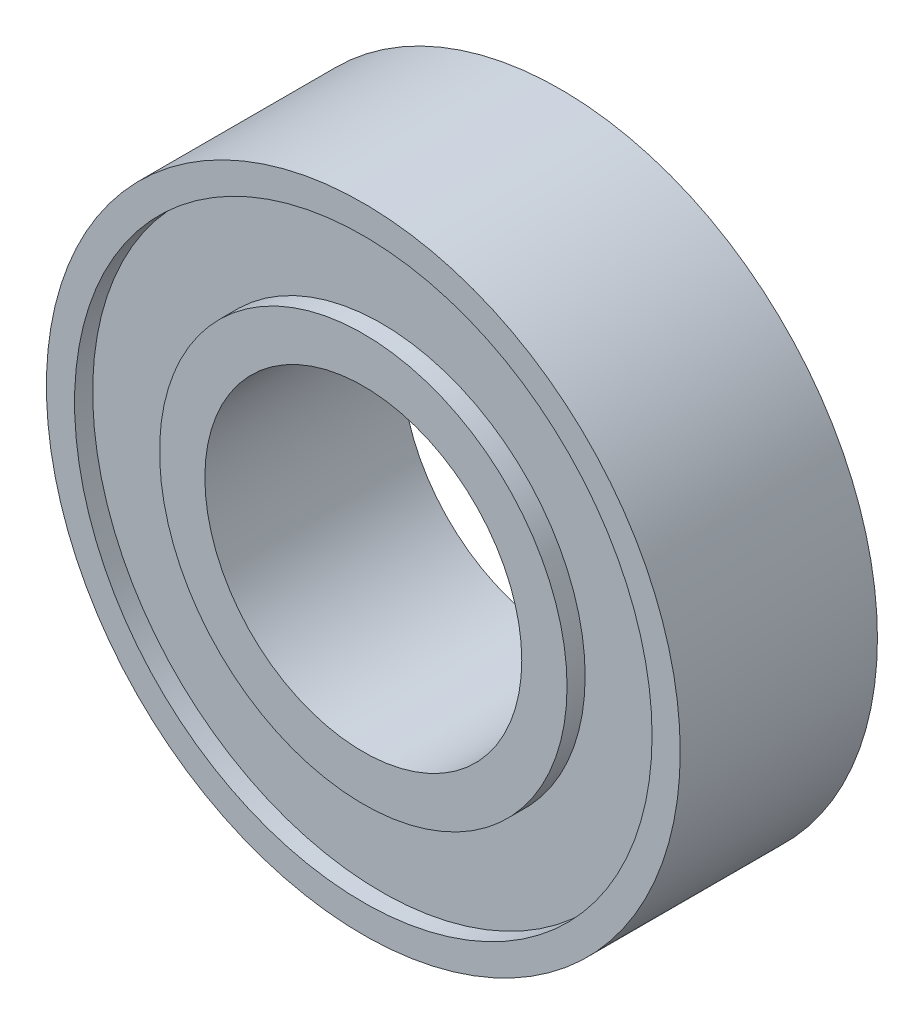
ISO-10303-21;
HEADER;
FILE_DESCRIPTION(('STEP AP214'),'2;1');
FILE_NAME('part.step','',(''),(''),'','','');
FILE_SCHEMA(('AUTOMOTIVE_DESIGN { 1 0 10303 214 1 1 1 1 }'));
ENDSEC;
DATA;
#1=APPLICATION_CONTEXT('core data for automotive mechanical design processes');
#2=APPLICATION_PROTOCOL_DEFINITION('international standard','automotive_design',2000,#1);
#3=PRODUCT_CONTEXT('',#1,'mechanical');
#4=PRODUCT('Part','Part','',(#3));
#5=PRODUCT_RELATED_PRODUCT_CATEGORY('part','',(#4));
#6=PRODUCT_DEFINITION_FORMATION('','',#4);
#7=PRODUCT_DEFINITION_CONTEXT('part definition',#1,'design');
#8=PRODUCT_DEFINITION('design','',#6,#7);
#9=PRODUCT_DEFINITION_SHAPE('','',#8);
#10=(LENGTH_UNIT() NAMED_UNIT(*) SI_UNIT(.MILLI.,.METRE.));
#11=(NAMED_UNIT(*) PLANE_ANGLE_UNIT() SI_UNIT($,.RADIAN.));
#12=(NAMED_UNIT(*) SI_UNIT($,.STERADIAN.) SOLID_ANGLE_UNIT());
#13=UNCERTAINTY_MEASURE_WITH_UNIT(LENGTH_MEASURE(1.E-05),#10,'distance_accuracy_value','');
#14=(GEOMETRIC_REPRESENTATION_CONTEXT(3) GLOBAL_UNCERTAINTY_ASSIGNED_CONTEXT((#13)) GLOBAL_UNIT_ASSIGNED_CONTEXT((#10,
#11,#12)) REPRESENTATION_CONTEXT('',''));
#15=CARTESIAN_POINT('',(0.,0.,0.));
#16=DIRECTION('',(0.,0.,1.));
#17=DIRECTION('',(1.,0.,0.));
#18=AXIS2_PLACEMENT_3D('',#15,#16,#17);
#19=CARTESIAN_POINT('',(0.,0.,0.));
#20=DIRECTION('',(0.,0.,1.));
#21=DIRECTION('',(1.,0.,0.));
#22=AXIS2_PLACEMENT_3D('',#19,#20,#21);
#23=PLANE('',#22);
#24=CARTESIAN_POINT('',(0.,0.,0.));
#25=DIRECTION('',(0.,0.,1.));
#26=DIRECTION('',(1.,0.,0.));
#27=AXIS2_PLACEMENT_3D('',#24,#25,#26);
#28=CIRCLE('',#27,4.0005);
#29=CARTESIAN_POINT('',(4.0005,0.,0.));
#30=VERTEX_POINT('',#29);
#31=EDGE_CURVE('E51',#30,#30,#28,.T.);
#32=ORIENTED_EDGE('',*,*,#31,.T.);
#33=EDGE_LOOP('',(#32));
#34=FACE_BOUND('',#33,.T.);
#35=CARTESIAN_POINT('',(0.,0.,0.));
#36=DIRECTION('',(0.,0.,-1.));
#37=DIRECTION('',(-1.,0.,0.));
#38=AXIS2_PLACEMENT_3D('',#35,#36,#37);
#39=CIRCLE('',#38,5.1435);
#40=CARTESIAN_POINT('',(-5.1435,0.,0.));
#41=VERTEX_POINT('',#40);
#42=EDGE_CURVE('E82',#41,#41,#39,.T.);
#43=ORIENTED_EDGE('',*,*,#42,.T.);
#44=EDGE_LOOP('',(#43));
#45=FACE_BOUND('',#44,.T.);
#46=ADVANCED_FACE('F34',(#34,#45),#23,.F.);
#47=CARTESIAN_POINT('',(0.,0.,4.9784));
#48=DIRECTION('',(0.,0.,1.));
#49=DIRECTION('',(1.,0.,0.));
#50=AXIS2_PLACEMENT_3D('',#47,#48,#49);
#51=PLANE('',#50);
#52=CARTESIAN_POINT('',(0.,0.,4.9784));
#53=DIRECTION('',(0.,0.,1.));
#54=DIRECTION('',(1.,0.,0.));
#55=AXIS2_PLACEMENT_3D('',#52,#53,#54);
#56=CIRCLE('',#55,4.0005);
#57=CARTESIAN_POINT('',(4.0005,0.,4.9784));
#58=VERTEX_POINT('',#57);
#59=EDGE_CURVE('E49',#58,#58,#56,.T.);
#60=ORIENTED_EDGE('',*,*,#59,.F.);
#61=EDGE_LOOP('',(#60));
#62=FACE_BOUND('',#61,.T.);
#63=CARTESIAN_POINT('',(0.,0.,4.9784));
#64=DIRECTION('',(0.,0.,1.));
#65=DIRECTION('',(1.,0.,0.));
#66=AXIS2_PLACEMENT_3D('',#63,#64,#65);
#67=CIRCLE('',#66,5.1435);
#68=CARTESIAN_POINT('',(5.1435,0.,4.9784));
#69=VERTEX_POINT('',#68);
#70=EDGE_CURVE('E66',#69,#69,#67,.T.);
#71=ORIENTED_EDGE('',*,*,#70,.T.);
#72=EDGE_LOOP('',(#71));
#73=FACE_BOUND('',#72,.T.);
#74=ADVANCED_FACE('F121',(#62,#73),#51,.T.);
#75=CARTESIAN_POINT('',(0.,0.,4.9784));
#76=DIRECTION('',(0.,0.,1.));
#77=DIRECTION('',(1.,0.,0.));
#78=AXIS2_PLACEMENT_3D('',#75,#76,#77);
#79=CIRCLE('',#78,7.2898);
#80=CARTESIAN_POINT('',(7.2898,0.,4.9784));
#81=VERTEX_POINT('',#80);
#82=EDGE_CURVE('E59',#81,#81,#79,.T.);
#83=ORIENTED_EDGE('',*,*,#82,.F.);
#84=EDGE_LOOP('',(#83));
#85=FACE_BOUND('',#84,.T.);
#86=CARTESIAN_POINT('',(0.,0.,4.9784));
#87=DIRECTION('',(0.,0.,1.));
#88=DIRECTION('',(1.,0.,0.));
#89=AXIS2_PLACEMENT_3D('',#86,#87,#88);
#90=CIRCLE('',#89,8.001);
#91=CARTESIAN_POINT('',(8.001,0.,4.9784));
#92=VERTEX_POINT('',#91);
#93=EDGE_CURVE('E10',#92,#92,#90,.T.);
#94=ORIENTED_EDGE('',*,*,#93,.T.);
#95=EDGE_LOOP('',(#94));
#96=FACE_BOUND('',#95,.T.);
#97=ADVANCED_FACE('F108',(#85,#96),#51,.T.);
#98=CARTESIAN_POINT('',(0.,0.,0.));
#99=DIRECTION('',(0.,0.,-1.));
#100=DIRECTION('',(-1.,0.,0.));
#101=AXIS2_PLACEMENT_3D('',#98,#99,#100);
#102=CIRCLE('',#101,7.2898);
#103=CARTESIAN_POINT('',(-7.2898,0.,0.));
#104=VERTEX_POINT('',#103);
#105=EDGE_CURVE('E74',#104,#104,#102,.T.);
#106=ORIENTED_EDGE('',*,*,#105,.F.);
#107=EDGE_LOOP('',(#106));
#108=FACE_BOUND('',#107,.T.);
#109=CARTESIAN_POINT('',(0.,0.,0.));
#110=DIRECTION('',(0.,0.,1.));
#111=DIRECTION('',(1.,0.,0.));
#112=AXIS2_PLACEMENT_3D('',#109,#110,#111);
#113=CIRCLE('',#112,8.001);
#114=CARTESIAN_POINT('',(8.001,0.,0.));
#115=VERTEX_POINT('',#114);
#116=EDGE_CURVE('E38',#115,#115,#113,.T.);
#117=ORIENTED_EDGE('',*,*,#116,.F.);
#118=EDGE_LOOP('',(#117));
#119=FACE_BOUND('',#118,.T.);
#120=ADVANCED_FACE('F105',(#108,#119),#23,.F.);
#121=CARTESIAN_POINT('',(0.,0.,4.9784));
#122=DIRECTION('',(0.,0.,-1.));
#123=DIRECTION('',(-1.,0.,0.));
#124=AXIS2_PLACEMENT_3D('',#121,#122,#123);
#125=CYLINDRICAL_SURFACE('',#124,8.001);
#126=ORIENTED_EDGE('',*,*,#93,.F.);
#127=EDGE_LOOP('',(#126));
#128=FACE_BOUND('',#127,.T.);
#129=ORIENTED_EDGE('',*,*,#116,.T.);
#130=EDGE_LOOP('',(#129));
#131=FACE_BOUND('',#130,.T.);
#132=ADVANCED_FACE('F36',(#128,#131),#125,.T.);
#133=CARTESIAN_POINT('',(0.,0.,4.9784));
#134=DIRECTION('',(0.,0.,-1.));
#135=DIRECTION('',(-1.,0.,0.));
#136=AXIS2_PLACEMENT_3D('',#133,#134,#135);
#137=CYLINDRICAL_SURFACE('',#136,4.0005);
#138=ORIENTED_EDGE('',*,*,#59,.T.);
#139=EDGE_LOOP('',(#138));
#140=FACE_BOUND('',#139,.T.);
#141=ORIENTED_EDGE('',*,*,#31,.F.);
#142=EDGE_LOOP('',(#141));
#143=FACE_BOUND('',#142,.T.);
#144=ADVANCED_FACE('F112',(#140,#143),#137,.F.);
#145=CARTESIAN_POINT('',(0.,0.,4.5212));
#146=DIRECTION('',(0.,0.,1.));
#147=DIRECTION('',(1.,0.,0.));
#148=AXIS2_PLACEMENT_3D('',#145,#146,#147);
#149=CYLINDRICAL_SURFACE('',#148,7.2898);
#150=CARTESIAN_POINT('',(0.,0.,4.5212));
#151=DIRECTION('',(0.,0.,1.));
#152=DIRECTION('',(1.,0.,0.));
#153=AXIS2_PLACEMENT_3D('',#150,#151,#152);
#154=CIRCLE('',#153,7.2898);
#155=CARTESIAN_POINT('',(7.2898,0.,4.5212));
#156=VERTEX_POINT('',#155);
#157=EDGE_CURVE('E55',#156,#156,#154,.T.);
#158=ORIENTED_EDGE('',*,*,#157,.F.);
#159=EDGE_LOOP('',(#158));
#160=FACE_BOUND('',#159,.T.);
#161=ORIENTED_EDGE('',*,*,#82,.T.);
#162=EDGE_LOOP('',(#161));
#163=FACE_BOUND('',#162,.T.);
#164=ADVANCED_FACE('F118',(#160,#163),#149,.F.);
#165=CARTESIAN_POINT('',(0.,0.,4.5212));
#166=DIRECTION('',(0.,0.,1.));
#167=DIRECTION('',(1.,0.,0.));
#168=AXIS2_PLACEMENT_3D('',#165,#166,#167);
#169=PLANE('',#168);
#170=CARTESIAN_POINT('',(0.,0.,4.5212));
#171=DIRECTION('',(0.,0.,1.));
#172=DIRECTION('',(1.,0.,0.));
#173=AXIS2_PLACEMENT_3D('',#170,#171,#172);
#174=CIRCLE('',#173,5.1435);
#175=CARTESIAN_POINT('',(5.1435,0.,4.5212));
#176=VERTEX_POINT('',#175);
#177=EDGE_CURVE('E62',#176,#176,#174,.T.);
#178=ORIENTED_EDGE('',*,*,#177,.F.);
#179=EDGE_LOOP('',(#178));
#180=FACE_BOUND('',#179,.T.);
#181=ORIENTED_EDGE('',*,*,#157,.T.);
#182=EDGE_LOOP('',(#181));
#183=FACE_BOUND('',#182,.T.);
#184=ADVANCED_FACE('F133',(#180,#183),#169,.T.);
#185=CARTESIAN_POINT('',(0.,0.,4.5212));
#186=DIRECTION('',(0.,0.,1.));
#187=DIRECTION('',(1.,0.,0.));
#188=AXIS2_PLACEMENT_3D('',#185,#186,#187);
#189=CYLINDRICAL_SURFACE('',#188,5.1435);
#190=ORIENTED_EDGE('',*,*,#177,.T.);
#191=EDGE_LOOP('',(#190));
#192=FACE_BOUND('',#191,.T.);
#193=ORIENTED_EDGE('',*,*,#70,.F.);
#194=EDGE_LOOP('',(#193));
#195=FACE_BOUND('',#194,.T.);
#196=ADVANCED_FACE('F101',(#192,#195),#189,.T.);
#197=CARTESIAN_POINT('',(0.,0.,0.4572));
#198=DIRECTION('',(0.,0.,-1.));
#199=DIRECTION('',(-1.,0.,0.));
#200=AXIS2_PLACEMENT_3D('',#197,#198,#199);
#201=CYLINDRICAL_SURFACE('',#200,7.2898);
#202=CARTESIAN_POINT('',(0.,0.,0.4572));
#203=DIRECTION('',(0.,0.,-1.));
#204=DIRECTION('',(-1.,0.,0.));
#205=AXIS2_PLACEMENT_3D('',#202,#203,#204);
#206=CIRCLE('',#205,7.2898);
#207=CARTESIAN_POINT('',(-7.2898,0.,0.4572));
#208=VERTEX_POINT('',#207);
#209=EDGE_CURVE('E70',#208,#208,#206,.T.);
#210=ORIENTED_EDGE('',*,*,#209,.F.);
#211=EDGE_LOOP('',(#210));
#212=FACE_BOUND('',#211,.T.);
#213=ORIENTED_EDGE('',*,*,#105,.T.);
#214=EDGE_LOOP('',(#213));
#215=FACE_BOUND('',#214,.T.);
#216=ADVANCED_FACE('F95',(#212,#215),#201,.F.);
#217=CARTESIAN_POINT('',(0.,0.,0.4572));
#218=DIRECTION('',(0.,0.,-1.));
#219=DIRECTION('',(-1.,0.,0.));
#220=AXIS2_PLACEMENT_3D('',#217,#218,#219);
#221=PLANE('',#220);
#222=CARTESIAN_POINT('',(0.,0.,0.4572));
#223=DIRECTION('',(0.,0.,-1.));
#224=DIRECTION('',(-1.,0.,0.));
#225=AXIS2_PLACEMENT_3D('',#222,#223,#224);
#226=CIRCLE('',#225,5.1435);
#227=CARTESIAN_POINT('',(-5.1435,0.,0.4572));
#228=VERTEX_POINT('',#227);
#229=EDGE_CURVE('E78',#228,#228,#226,.T.);
#230=ORIENTED_EDGE('',*,*,#229,.F.);
#231=EDGE_LOOP('',(#230));
#232=FACE_BOUND('',#231,.T.);
#233=ORIENTED_EDGE('',*,*,#209,.T.);
#234=EDGE_LOOP('',(#233));
#235=FACE_BOUND('',#234,.T.);
#236=ADVANCED_FACE('F92',(#232,#235),#221,.T.);
#237=CARTESIAN_POINT('',(0.,0.,0.4572));
#238=DIRECTION('',(0.,0.,-1.));
#239=DIRECTION('',(-1.,0.,0.));
#240=AXIS2_PLACEMENT_3D('',#237,#238,#239);
#241=CYLINDRICAL_SURFACE('',#240,5.1435);
#242=ORIENTED_EDGE('',*,*,#229,.T.);
#243=EDGE_LOOP('',(#242));
#244=FACE_BOUND('',#243,.T.);
#245=ORIENTED_EDGE('',*,*,#42,.F.);
#246=EDGE_LOOP('',(#245));
#247=FACE_BOUND('',#246,.T.);
#248=ADVANCED_FACE('F89',(#244,#247),#241,.T.);
#249=CLOSED_SHELL('',(#46,#74,#97,#120,#132,#144,#164,#184,#196,#216,#236,#248));
#250=MANIFOLD_SOLID_BREP('B2',#249);
#251=ADVANCED_BREP_SHAPE_REPRESENTATION('',(#18,#250),#14);
#252=SHAPE_DEFINITION_REPRESENTATION(#9,#251);
ENDSEC;
END-ISO-10303-21;
